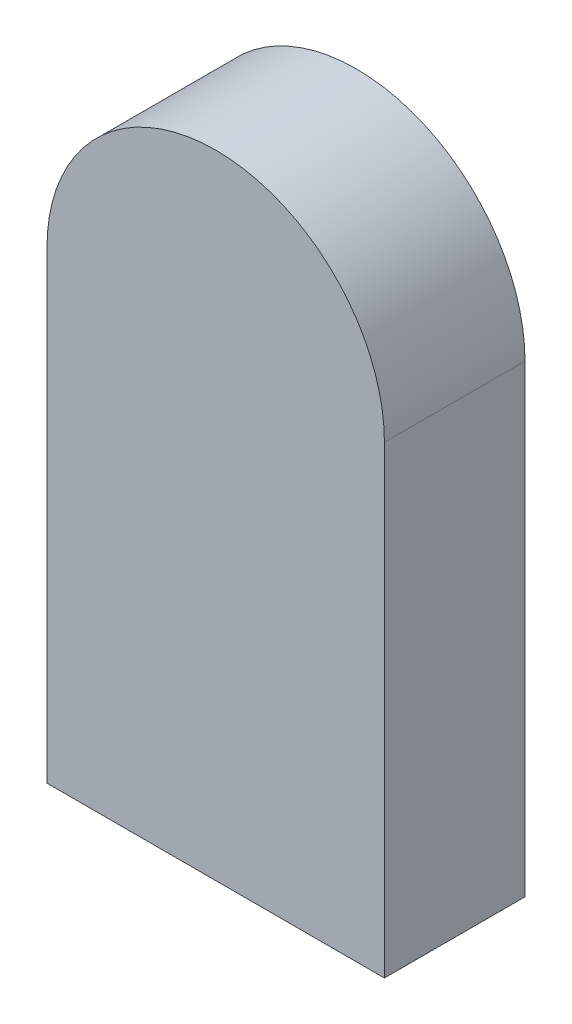
ISO-10303-21;
HEADER;
FILE_DESCRIPTION(('STEP AP214'),'2;1');
FILE_NAME('part.step','',(''),(''),'','','');
FILE_SCHEMA(('AUTOMOTIVE_DESIGN { 1 0 10303 214 1 1 1 1 }'));
ENDSEC;
DATA;
#1=APPLICATION_CONTEXT('core data for automotive mechanical design processes');
#2=APPLICATION_PROTOCOL_DEFINITION('international standard','automotive_design',2000,#1);
#3=PRODUCT_CONTEXT('',#1,'mechanical');
#4=PRODUCT('Part','Part','',(#3));
#5=PRODUCT_RELATED_PRODUCT_CATEGORY('part','',(#4));
#6=PRODUCT_DEFINITION_FORMATION('','',#4);
#7=PRODUCT_DEFINITION_CONTEXT('part definition',#1,'design');
#8=PRODUCT_DEFINITION('design','',#6,#7);
#9=PRODUCT_DEFINITION_SHAPE('','',#8);
#10=(LENGTH_UNIT() NAMED_UNIT(*) SI_UNIT(.MILLI.,.METRE.));
#11=(NAMED_UNIT(*) PLANE_ANGLE_UNIT() SI_UNIT($,.RADIAN.));
#12=(NAMED_UNIT(*) SI_UNIT($,.STERADIAN.) SOLID_ANGLE_UNIT());
#13=UNCERTAINTY_MEASURE_WITH_UNIT(LENGTH_MEASURE(1.E-05),#10,'distance_accuracy_value','');
#14=(GEOMETRIC_REPRESENTATION_CONTEXT(3) GLOBAL_UNCERTAINTY_ASSIGNED_CONTEXT((#13)) GLOBAL_UNIT_ASSIGNED_CONTEXT((#10,
#11,#12)) REPRESENTATION_CONTEXT('',''));
#15=CARTESIAN_POINT('',(0.,0.,0.));
#16=DIRECTION('',(0.,0.,1.));
#17=DIRECTION('',(1.,0.,0.));
#18=AXIS2_PLACEMENT_3D('',#15,#16,#17);
#19=CARTESIAN_POINT('',(-1.87,-4.05,0.));
#20=DIRECTION('',(0.,1.,0.));
#21=DIRECTION('',(1.,0.,0.));
#22=AXIS2_PLACEMENT_3D('',#19,#20,#21);
#23=PLANE('',#22);
#24=DIRECTION('',(1.,0.,0.));
#25=VECTOR('',#24,1.);
#26=CARTESIAN_POINT('',(-1.87,-4.05,0.));
#27=LINE('',#26,#25);
#28=CARTESIAN_POINT('',(-1.87,-4.05,0.));
#29=VERTEX_POINT('',#28);
#30=CARTESIAN_POINT('',(-1.63,-4.05,0.));
#31=VERTEX_POINT('',#30);
#32=EDGE_CURVE('E11',#29,#31,#27,.T.);
#33=ORIENTED_EDGE('',*,*,#32,.T.);
#34=DIRECTION('',(0.,0.,1.));
#35=VECTOR('',#34,1.);
#36=CARTESIAN_POINT('',(-1.63,-4.05,0.));
#37=LINE('',#36,#35);
#38=CARTESIAN_POINT('',(-1.63,-4.05,0.1));
#39=VERTEX_POINT('',#38);
#40=EDGE_CURVE('E24',#31,#39,#37,.T.);
#41=ORIENTED_EDGE('',*,*,#40,.T.);
#42=DIRECTION('',(1.,0.,0.));
#43=VECTOR('',#42,1.);
#44=CARTESIAN_POINT('',(-1.87,-4.05,0.1));
#45=LINE('',#44,#43);
#46=CARTESIAN_POINT('',(-1.87,-4.05,0.1));
#47=VERTEX_POINT('',#46);
#48=EDGE_CURVE('E87',#47,#39,#45,.T.);
#49=ORIENTED_EDGE('',*,*,#48,.F.);
#50=DIRECTION('',(0.,0.,1.));
#51=VECTOR('',#50,1.);
#52=CARTESIAN_POINT('',(-1.87,-4.05,0.));
#53=LINE('',#52,#51);
#54=EDGE_CURVE('E36',#29,#47,#53,.T.);
#55=ORIENTED_EDGE('',*,*,#54,.F.);
#56=EDGE_LOOP('',(#33,#41,#49,#55));
#57=FACE_BOUND('',#56,.T.);
#58=ADVANCED_FACE('F17',(#57),#23,.F.);
#59=CARTESIAN_POINT('',(-1.63,-4.05,0.));
#60=DIRECTION('',(-1.,0.,0.));
#61=DIRECTION('',(0.,1.,0.));
#62=AXIS2_PLACEMENT_3D('',#59,#60,#61);
#63=PLANE('',#62);
#64=DIRECTION('',(0.,1.,0.));
#65=VECTOR('',#64,1.);
#66=CARTESIAN_POINT('',(-1.63,-4.05,0.));
#67=LINE('',#66,#65);
#68=CARTESIAN_POINT('',(-1.63,-3.72,0.));
#69=VERTEX_POINT('',#68);
#70=EDGE_CURVE('E84',#31,#69,#67,.T.);
#71=ORIENTED_EDGE('',*,*,#70,.T.);
#72=DIRECTION('',(0.,0.,1.));
#73=VECTOR('',#72,1.);
#74=CARTESIAN_POINT('',(-1.63,-3.72,0.));
#75=LINE('',#74,#73);
#76=CARTESIAN_POINT('',(-1.63,-3.72,0.1));
#77=VERTEX_POINT('',#76);
#78=EDGE_CURVE('E82',#69,#77,#75,.T.);
#79=ORIENTED_EDGE('',*,*,#78,.T.);
#80=DIRECTION('',(0.,1.,0.));
#81=VECTOR('',#80,1.);
#82=CARTESIAN_POINT('',(-1.63,-4.05,0.1));
#83=LINE('',#82,#81);
#84=EDGE_CURVE('E72',#39,#77,#83,.T.);
#85=ORIENTED_EDGE('',*,*,#84,.F.);
#86=ORIENTED_EDGE('',*,*,#40,.F.);
#87=EDGE_LOOP('',(#71,#79,#85,#86));
#88=FACE_BOUND('',#87,.T.);
#89=ADVANCED_FACE('F89',(#88),#63,.F.);
#90=CARTESIAN_POINT('',(-1.75,-3.72,0.));
#91=DIRECTION('',(0.,0.,-1.));
#92=DIRECTION('',(1.,0.,0.));
#93=AXIS2_PLACEMENT_3D('',#90,#91,#92);
#94=CYLINDRICAL_SURFACE('',#93,0.12);
#95=CARTESIAN_POINT('',(-1.75,-3.72,0.));
#96=DIRECTION('',(0.,0.,1.));
#97=DIRECTION('',(1.,0.,0.));
#98=AXIS2_PLACEMENT_3D('',#95,#96,#97);
#99=CIRCLE('',#98,0.12);
#100=CARTESIAN_POINT('',(-1.87,-3.72,0.));
#101=VERTEX_POINT('',#100);
#102=EDGE_CURVE('E62',#69,#101,#99,.T.);
#103=ORIENTED_EDGE('',*,*,#102,.T.);
#104=DIRECTION('',(0.,0.,1.));
#105=VECTOR('',#104,1.);
#106=CARTESIAN_POINT('',(-1.87,-3.72,0.));
#107=LINE('',#106,#105);
#108=CARTESIAN_POINT('',(-1.87,-3.72,0.1));
#109=VERTEX_POINT('',#108);
#110=EDGE_CURVE('E57',#101,#109,#107,.T.);
#111=ORIENTED_EDGE('',*,*,#110,.T.);
#112=CARTESIAN_POINT('',(-1.75,-3.72,0.1));
#113=DIRECTION('',(0.,0.,1.));
#114=DIRECTION('',(1.,0.,0.));
#115=AXIS2_PLACEMENT_3D('',#112,#113,#114);
#116=CIRCLE('',#115,0.12);
#117=EDGE_CURVE('E60',#77,#109,#116,.T.);
#118=ORIENTED_EDGE('',*,*,#117,.F.);
#119=ORIENTED_EDGE('',*,*,#78,.F.);
#120=EDGE_LOOP('',(#103,#111,#118,#119));
#121=FACE_BOUND('',#120,.T.);
#122=ADVANCED_FACE('F59',(#121),#94,.T.);
#123=CARTESIAN_POINT('',(-1.87,-4.05,0.));
#124=DIRECTION('',(-1.,0.,0.));
#125=DIRECTION('',(0.,1.,0.));
#126=AXIS2_PLACEMENT_3D('',#123,#124,#125);
#127=PLANE('',#126);
#128=ORIENTED_EDGE('',*,*,#54,.T.);
#129=DIRECTION('',(0.,1.,0.));
#130=VECTOR('',#129,1.);
#131=CARTESIAN_POINT('',(-1.87,-4.05,0.1));
#132=LINE('',#131,#130);
#133=EDGE_CURVE('E71',#47,#109,#132,.T.);
#134=ORIENTED_EDGE('',*,*,#133,.T.);
#135=ORIENTED_EDGE('',*,*,#110,.F.);
#136=DIRECTION('',(0.,1.,0.));
#137=VECTOR('',#136,1.);
#138=CARTESIAN_POINT('',(-1.87,-4.05,0.));
#139=LINE('',#138,#137);
#140=EDGE_CURVE('E76',#29,#101,#139,.T.);
#141=ORIENTED_EDGE('',*,*,#140,.F.);
#142=EDGE_LOOP('',(#128,#134,#135,#141));
#143=FACE_BOUND('',#142,.T.);
#144=ADVANCED_FACE('F75',(#143),#127,.T.);
#145=CARTESIAN_POINT('',(-1.75,-3.849490847913,0.));
#146=DIRECTION('',(0.,0.,1.));
#147=DIRECTION('',(1.,0.,0.));
#148=AXIS2_PLACEMENT_3D('',#145,#146,#147);
#149=PLANE('',#148);
#150=ORIENTED_EDGE('',*,*,#140,.T.);
#151=ORIENTED_EDGE('',*,*,#102,.F.);
#152=ORIENTED_EDGE('',*,*,#70,.F.);
#153=ORIENTED_EDGE('',*,*,#32,.F.);
#154=EDGE_LOOP('',(#150,#151,#152,#153));
#155=FACE_BOUND('',#154,.T.);
#156=ADVANCED_FACE('F91',(#155),#149,.F.);
#157=CARTESIAN_POINT('',(-1.75,-3.849490847913,0.1));
#158=DIRECTION('',(0.,0.,1.));
#159=DIRECTION('',(1.,0.,0.));
#160=AXIS2_PLACEMENT_3D('',#157,#158,#159);
#161=PLANE('',#160);
#162=ORIENTED_EDGE('',*,*,#48,.T.);
#163=ORIENTED_EDGE('',*,*,#84,.T.);
#164=ORIENTED_EDGE('',*,*,#117,.T.);
#165=ORIENTED_EDGE('',*,*,#133,.F.);
#166=EDGE_LOOP('',(#162,#163,#164,#165));
#167=FACE_BOUND('',#166,.T.);
#168=ADVANCED_FACE('F70',(#167),#161,.T.);
#169=CLOSED_SHELL('',(#58,#89,#122,#144,#156,#168));
#170=MANIFOLD_SOLID_BREP('B1',#169);
#171=ADVANCED_BREP_SHAPE_REPRESENTATION('',(#18,#170),#14);
#172=SHAPE_DEFINITION_REPRESENTATION(#9,#171);
ENDSEC;
END-ISO-10303-21;
